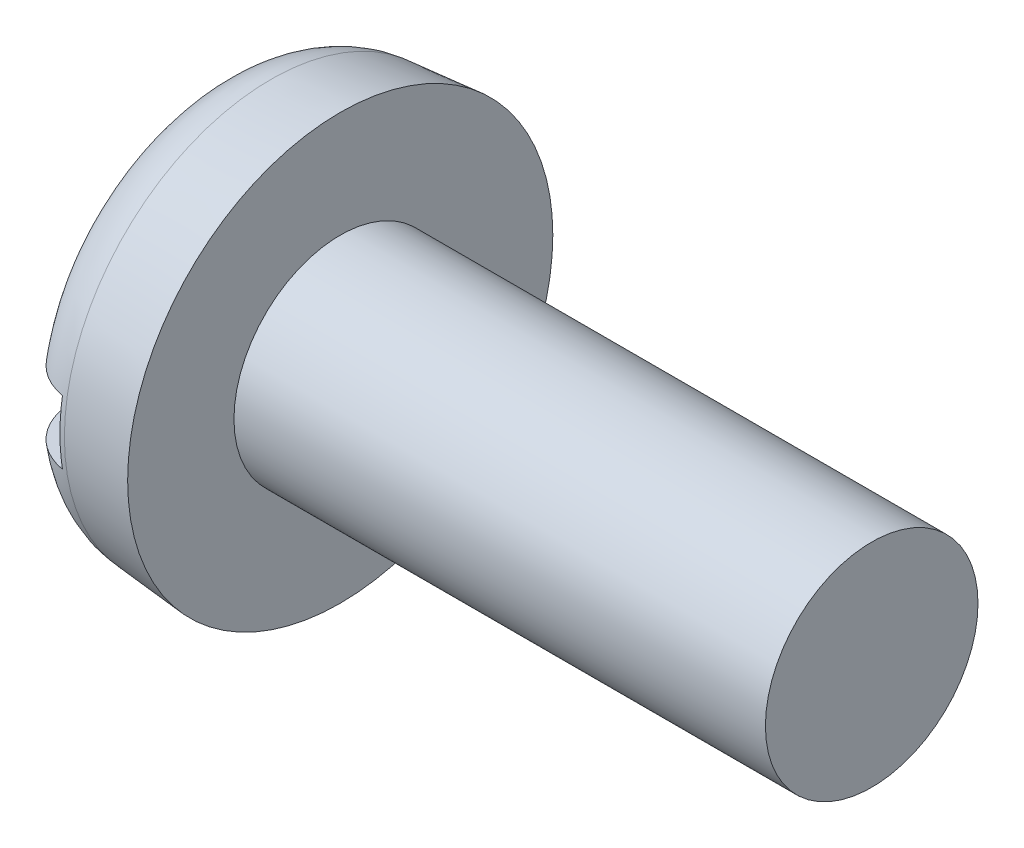
ISO-10303-21;
HEADER;
FILE_DESCRIPTION(('STEP AP214'),'2;1');
FILE_NAME('part.step','',(''),(''),'','','');
FILE_SCHEMA(('AUTOMOTIVE_DESIGN { 1 0 10303 214 1 1 1 1 }'));
ENDSEC;
DATA;
#1=APPLICATION_CONTEXT('core data for automotive mechanical design processes');
#2=APPLICATION_PROTOCOL_DEFINITION('international standard','automotive_design',2000,#1);
#3=PRODUCT_CONTEXT('',#1,'mechanical');
#4=PRODUCT('Part','Part','',(#3));
#5=PRODUCT_RELATED_PRODUCT_CATEGORY('part','',(#4));
#6=PRODUCT_DEFINITION_FORMATION('','',#4);
#7=PRODUCT_DEFINITION_CONTEXT('part definition',#1,'design');
#8=PRODUCT_DEFINITION('design','',#6,#7);
#9=PRODUCT_DEFINITION_SHAPE('','',#8);
#10=(LENGTH_UNIT() NAMED_UNIT(*) SI_UNIT(.MILLI.,.METRE.));
#11=(NAMED_UNIT(*) PLANE_ANGLE_UNIT() SI_UNIT($,.RADIAN.));
#12=(NAMED_UNIT(*) SI_UNIT($,.STERADIAN.) SOLID_ANGLE_UNIT());
#13=UNCERTAINTY_MEASURE_WITH_UNIT(LENGTH_MEASURE(1.E-05),#10,'distance_accuracy_value','');
#14=(GEOMETRIC_REPRESENTATION_CONTEXT(3) GLOBAL_UNCERTAINTY_ASSIGNED_CONTEXT((#13)) GLOBAL_UNIT_ASSIGNED_CONTEXT((#10,
#11,#12)) REPRESENTATION_CONTEXT('',''));
#15=CARTESIAN_POINT('',(0.,0.,0.));
#16=DIRECTION('',(0.,0.,1.));
#17=DIRECTION('',(1.,0.,0.));
#18=AXIS2_PLACEMENT_3D('',#15,#16,#17);
#19=CARTESIAN_POINT('',(0.,0.,0.));
#20=DIRECTION('',(-1.,0.,0.));
#21=DIRECTION('',(0.,0.,1.));
#22=AXIS2_PLACEMENT_3D('',#19,#20,#21);
#23=PLANE('',#22);
#24=DIRECTION('',(0.,0.,-1.));
#25=VECTOR('',#24,1.);
#26=CARTESIAN_POINT('',(0.,0.599999999999999,4.));
#27=LINE('',#26,#25);
#28=CARTESIAN_POINT('',(0.,0.599999999999999,2.62267277825956));
#29=VERTEX_POINT('',#28);
#30=CARTESIAN_POINT('',(0.,0.599999999999999,-2.62267277825956));
#31=VERTEX_POINT('',#30);
#32=EDGE_CURVE('E85',#29,#31,#27,.T.);
#33=ORIENTED_EDGE('',*,*,#32,.F.);
#34=CARTESIAN_POINT('',(0.,0.,0.));
#35=DIRECTION('',(-1.,0.,0.));
#36=DIRECTION('',(0.,0.,1.));
#37=AXIS2_PLACEMENT_3D('',#34,#35,#36);
#38=CIRCLE('',#37,2.69042979871687);
#39=EDGE_CURVE('E91',#29,#31,#38,.T.);
#40=ORIENTED_EDGE('',*,*,#39,.T.);
#41=EDGE_LOOP('',(#33,#40));
#42=FACE_BOUND('',#41,.T.);
#43=ADVANCED_FACE('F32',(#42),#23,.T.);
#44=CARTESIAN_POINT('',(-25.4,0.,0.));
#45=DIRECTION('',(-1.,0.,0.));
#46=DIRECTION('',(0.,0.,1.));
#47=AXIS2_PLACEMENT_3D('',#44,#45,#46);
#48=CYLINDRICAL_SURFACE('',#47,2.);
#49=CARTESIAN_POINT('',(12.4,0.,0.));
#50=DIRECTION('',(-1.,0.,0.));
#51=DIRECTION('',(0.,0.,1.));
#52=AXIS2_PLACEMENT_3D('',#49,#50,#51);
#53=CIRCLE('',#52,2.);
#54=CARTESIAN_POINT('',(12.4,0.,2.));
#55=VERTEX_POINT('',#54);
#56=EDGE_CURVE('E148',#55,#55,#53,.T.);
#57=ORIENTED_EDGE('',*,*,#56,.T.);
#58=EDGE_LOOP('',(#57));
#59=FACE_BOUND('',#58,.T.);
#60=CARTESIAN_POINT('',(2.4,0.,0.));
#61=DIRECTION('',(-1.,0.,0.));
#62=DIRECTION('',(0.,0.,1.));
#63=AXIS2_PLACEMENT_3D('',#60,#61,#62);
#64=CIRCLE('',#63,2.);
#65=CARTESIAN_POINT('',(2.4,0.,2.));
#66=VERTEX_POINT('',#65);
#67=EDGE_CURVE('E92',#66,#66,#64,.T.);
#68=ORIENTED_EDGE('',*,*,#67,.F.);
#69=EDGE_LOOP('',(#68));
#70=FACE_BOUND('',#69,.T.);
#71=ADVANCED_FACE('F137',(#59,#70),#48,.T.);
#72=CARTESIAN_POINT('',(2.4,2.,0.));
#73=DIRECTION('',(-1.,0.,0.));
#74=DIRECTION('',(0.,0.,1.));
#75=AXIS2_PLACEMENT_3D('',#72,#73,#74);
#76=PLANE('',#75);
#77=CARTESIAN_POINT('',(2.4,0.,0.));
#78=DIRECTION('',(-1.,0.,0.));
#79=DIRECTION('',(0.,0.,1.));
#80=AXIS2_PLACEMENT_3D('',#77,#78,#79);
#81=CIRCLE('',#80,4.);
#82=CARTESIAN_POINT('',(2.4,0.,4.));
#83=VERTEX_POINT('',#82);
#84=EDGE_CURVE('E97',#83,#83,#81,.T.);
#85=ORIENTED_EDGE('',*,*,#84,.F.);
#86=EDGE_LOOP('',(#85));
#87=FACE_BOUND('',#86,.T.);
#88=ORIENTED_EDGE('',*,*,#67,.T.);
#89=EDGE_LOOP('',(#88));
#90=FACE_BOUND('',#89,.T.);
#91=ADVANCED_FACE('F134',(#87,#90),#76,.F.);
#92=CARTESIAN_POINT('',(0.,0.,0.));
#93=DIRECTION('',(1.,0.,0.));
#94=DIRECTION('',(0.,0.,-1.));
#95=AXIS2_PLACEMENT_3D('',#92,#93,#94);
#96=CONICAL_SURFACE('',#95,3.79002720753778,0.0872664625997168);
#97=CARTESIAN_POINT('',(1.09541310870281,0.,0.));
#98=DIRECTION('',(-1.,0.,0.));
#99=DIRECTION('',(0.,0.,1.));
#100=AXIS2_PLACEMENT_3D('',#97,#98,#99);
#101=CIRCLE('',#100,3.88586343642697);
#102=CARTESIAN_POINT('',(1.09541310870281,0.,3.88586343642697));
#103=VERTEX_POINT('',#102);
#104=EDGE_CURVE('E95',#103,#103,#101,.F.);
#105=ORIENTED_EDGE('',*,*,#104,.T.);
#106=EDGE_LOOP('',(#105));
#107=FACE_BOUND('',#106,.T.);
#108=ORIENTED_EDGE('',*,*,#84,.T.);
#109=EDGE_LOOP('',(#108));
#110=FACE_BOUND('',#109,.T.);
#111=ADVANCED_FACE('F131',(#107,#110),#96,.T.);
#112=DIRECTION('',(0.,0.,1.));
#113=VECTOR('',#112,1.);
#114=CARTESIAN_POINT('',(0.,-0.599999999999999,-4.));
#115=LINE('',#114,#113);
#116=CARTESIAN_POINT('',(0.,-0.6,-2.62267277825956));
#117=VERTEX_POINT('',#116);
#118=CARTESIAN_POINT('',(0.,-0.6,2.62267277825956));
#119=VERTEX_POINT('',#118);
#120=EDGE_CURVE('E76',#117,#119,#115,.T.);
#121=ORIENTED_EDGE('',*,*,#120,.F.);
#122=EDGE_CURVE('E83',#117,#119,#38,.T.);
#123=ORIENTED_EDGE('',*,*,#122,.T.);
#124=EDGE_LOOP('',(#121,#123));
#125=FACE_BOUND('',#124,.T.);
#126=ADVANCED_FACE('F82',(#125),#23,.T.);
#127=CARTESIAN_POINT('',(12.4,2.,0.));
#128=DIRECTION('',(1.,0.,0.));
#129=DIRECTION('',(0.,0.,-1.));
#130=AXIS2_PLACEMENT_3D('',#127,#128,#129);
#131=PLANE('',#130);
#132=ORIENTED_EDGE('',*,*,#56,.F.);
#133=EDGE_LOOP('',(#132));
#134=FACE_BOUND('',#133,.T.);
#135=ADVANCED_FACE('F124',(#134),#131,.T.);
#136=CARTESIAN_POINT('',(1.2,0.,0.));
#137=DIRECTION('',(-1.,0.,0.));
#138=DIRECTION('',(0.,0.,1.));
#139=AXIS2_PLACEMENT_3D('',#136,#137,#138);
#140=TOROIDAL_SURFACE('',#139,2.69042979871687,1.2);
#141=CARTESIAN_POINT('',(0.3865043853169,0.599999999999999,-3.52185650961921));
#142=CARTESIAN_POINT('',(0.435468376809704,0.599999999999999,-3.56765543950952));
#143=CARTESIAN_POINT('',(0.48830443166393,0.599999999999999,-3.60938194550438));
#144=CARTESIAN_POINT('',(0.600265100914025,0.599999999999999,-3.68342203989747));
#145=CARTESIAN_POINT('',(0.659396459727369,0.599999999999999,-3.71572539150948));
#146=CARTESIAN_POINT('',(0.782252800606727,0.599999999999999,-3.76991557956983));
#147=CARTESIAN_POINT('',(0.845977179530534,0.599999999999999,-3.79180378084656));
#148=CARTESIAN_POINT('',(0.976191754222355,0.599999999999999,-3.82450279747539));
#149=CARTESIAN_POINT('',(1.04268130135997,0.599999999999999,-3.83531619558205));
#150=CARTESIAN_POINT('',(1.1761990045803,0.599999999999999,-3.84552483404158));
#151=CARTESIAN_POINT('',(1.2432228557012,0.599999999999999,-3.84497642083092));
#152=CARTESIAN_POINT('',(1.37622462279157,0.599999999999999,-3.83261582080468));
#153=CARTESIAN_POINT('',(1.44220252316781,0.599999999999999,-3.82080346622443));
#154=CARTESIAN_POINT('',(1.57113854491409,0.599999999999999,-3.7862937263228));
#155=CARTESIAN_POINT('',(1.63410108094123,0.599999999999999,-3.76361282457044));
#156=CARTESIAN_POINT('',(1.75534617576328,0.599999999999999,-3.70804459286004));
#157=CARTESIAN_POINT('',(1.81362870200937,0.599999999999999,-3.67515719192498));
#158=CARTESIAN_POINT('',(1.92413366286082,0.599999999999999,-3.5999836273889));
#159=CARTESIAN_POINT('',(1.97632984172852,0.599999999999999,-3.55765888229068));
#160=CARTESIAN_POINT('',(2.07296076151814,0.599999999999999,-3.46492588821896));
#161=CARTESIAN_POINT('',(2.11739523777237,0.599999999999999,-3.4145173637076));
#162=CARTESIAN_POINT('',(2.19773705811253,0.599999999999999,-3.30652404667824));
#163=CARTESIAN_POINT('',(2.2335546401034,0.599999999999999,-3.24887250133257));
#164=CARTESIAN_POINT('',(2.29517588977537,0.599999999999999,-3.12844912915973));
#165=CARTESIAN_POINT('',(2.32097889847265,0.599999999999999,-3.06567696571194));
#166=CARTESIAN_POINT('',(2.36230436492476,0.599999999999999,-2.93572304072211));
#167=CARTESIAN_POINT('',(2.37765465772828,0.599999999999999,-2.86848656449));
#168=CARTESIAN_POINT('',(2.39710654163142,0.599999999999999,-2.73240889874387));
#169=CARTESIAN_POINT('',(2.40120699584,0.599999999999999,-2.66356754775263));
#170=CARTESIAN_POINT('',(2.39814758674929,0.599999999999999,-2.52464946510971));
#171=CARTESIAN_POINT('',(2.39074269705667,0.599999999999999,-2.45457815120699));
#172=CARTESIAN_POINT('',(2.36454808289107,0.599999999999999,-2.31659764121423));
#173=CARTESIAN_POINT('',(2.34575688405122,0.599999999999999,-2.24868872632324));
#174=CARTESIAN_POINT('',(2.29682890298537,0.599999999999999,-2.11531585439699));
#175=CARTESIAN_POINT('',(2.26644200737333,0.599999999999999,-2.04994358052463));
#176=CARTESIAN_POINT('',(2.19524076438291,0.599999999999999,-1.92513363217192));
#177=CARTESIAN_POINT('',(2.15442449061928,0.599999999999999,-1.86569705688398));
#178=CARTESIAN_POINT('',(2.06294283615072,0.599999999999999,-1.75389115472998));
#179=CARTESIAN_POINT('',(2.01217853911869,0.599999999999999,-1.70160258750062));
#180=CARTESIAN_POINT('',(1.90235992553189,0.599999999999999,-1.60657192610496));
#181=CARTESIAN_POINT('',(1.84330597883632,0.599999999999999,-1.56382940624313));
#182=CARTESIAN_POINT('',(1.72028944869469,0.599999999999999,-1.49071034856236));
#183=CARTESIAN_POINT('',(1.65652070699639,0.599999999999999,-1.46000898173593));
#184=CARTESIAN_POINT('',(1.52445964441105,0.599999999999999,-1.41076217920832));
#185=CARTESIAN_POINT('',(1.45617085097405,0.599999999999999,-1.39220738465179));
#186=CARTESIAN_POINT('',(1.32258878880617,0.599999999999999,-1.3692588518075));
#187=CARTESIAN_POINT('',(1.25746124888691,0.599999999999999,-1.36389765676798));
#188=CARTESIAN_POINT('',(1.12729576266396,0.599999999999999,-1.36480396434978));
#189=CARTESIAN_POINT('',(1.06225779788543,0.599999999999999,-1.37106853009552));
#190=CARTESIAN_POINT('',(0.937361276352802,0.599999999999999,-1.39427975018108));
#191=CARTESIAN_POINT('',(0.877403715043033,0.599999999999999,-1.41070181584546));
#192=CARTESIAN_POINT('',(0.760914633899446,0.599999999999999,-1.45296891322572));
#193=CARTESIAN_POINT('',(0.704383858553245,0.599999999999999,-1.47881598407843));
#194=CARTESIAN_POINT('',(0.59370506692464,0.599999999999999,-1.54020998774752));
#195=CARTESIAN_POINT('',(0.539760317072122,0.599999999999999,-1.57612236406225));
#196=CARTESIAN_POINT('',(0.438104558678888,0.599999999999999,-1.65588570791735));
#197=CARTESIAN_POINT('',(0.390395455034547,0.599999999999999,-1.69973909160234));
#198=CARTESIAN_POINT('',(0.298820307456313,0.599999999999999,-1.79776253460882));
#199=CARTESIAN_POINT('',(0.255521278582641,0.599999999999999,-1.85246315819191));
#200=CARTESIAN_POINT('',(0.178283828688256,0.599999999999999,-1.96812037142371));
#201=CARTESIAN_POINT('',(0.144347592259656,0.599999999999999,-2.02907841655305));
#202=CARTESIAN_POINT('',(0.0855336536520217,0.599999999999999,-2.15824220692981));
#203=CARTESIAN_POINT('',(0.0610804571278224,0.599999999999999,-2.22664188136111));
#204=CARTESIAN_POINT('',(0.0240295264344845,0.599999999999999,-2.36658228123931));
#205=CARTESIAN_POINT('',(0.0114315794261263,0.599999999999999,-2.43812295027129));
#206=CARTESIAN_POINT('',(-0.00140349275074647,0.599999999999999,-2.58214276994531));
#207=CARTESIAN_POINT('',(-0.00166960935095198,0.599999999999999,-2.65461931871753));
#208=CARTESIAN_POINT('',(0.0102529782153528,0.599999999999999,-2.79856484207324));
#209=CARTESIAN_POINT('',(0.0224436067069672,0.599999999999999,-2.87003365925244));
#210=CARTESIAN_POINT('',(0.0586721532419449,0.599999999999999,-3.00828260141836));
#211=CARTESIAN_POINT('',(0.082454203778735,0.599999999999999,-3.07512990163236));
#212=CARTESIAN_POINT('',(0.141152556498101,0.599999999999999,-3.20367573836961));
#213=CARTESIAN_POINT('',(0.176053519221631,0.599999999999999,-3.26538122136565));
#214=CARTESIAN_POINT('',(0.240740330961717,0.599999999999999,-3.35956174501863));
#215=CARTESIAN_POINT('',(0.267410079737719,0.599999999999999,-3.39421743119418));
#216=CARTESIAN_POINT('',(0.324340073246241,0.599999999999999,-3.46044388227296));
#217=CARTESIAN_POINT('',(0.354600266126854,0.599999999999999,-3.49201469171488));
#218=CARTESIAN_POINT('',(0.3865043853169,0.599999999999999,-3.52185650961921));
#219=B_SPLINE_CURVE_WITH_KNOTS('',3,(#141,#142,#143,#144,#145,#146,#147,#148,#149,#150,#151,
#152,#153,#154,#155,#156,#157,#158,#159,#160,#161,#162,#163,#164,#165,#166,#167,#168,#169,#170,
#171,#172,#173,#174,#175,#176,#177,#178,#179,#180,#181,#182,#183,#184,#185,#186,#187,#188,#189,
#190,#191,#192,#193,#194,#195,#196,#197,#198,#199,#200,#201,#202,#203,#204,#205,#206,#207,#208,
#209,#210,#211,#212,#213,#214,#215,#216,#217,#218),.UNSPECIFIED.,.T.,.F.,(4,2,2,2,2,2,2,2,2,2,2,
2,2,2,2,2,2,2,2,2,2,2,2,2,2,2,2,2,2,2,2,2,2,2,2,2,2,2,4),(0.,0.200976827189781,
0.402171178117275,0.603339156747841,0.804460210309258,1.0045840875019,1.2047109453777,
1.40453524080546,1.60436092586269,1.80501901970634,2.00568395449112,2.2083565471812,
2.41104247397172,2.61699090874966,2.82296015558702,3.03337636492947,3.24381982603506,
3.45908552978543,3.67439102352243,3.8919572416663,4.10951375574479,4.32071351243114,
4.53175034894182,4.72677835820256,4.92175710659851,5.10742155193663,5.29312619036203,
5.48672044544048,5.68037370311709,5.88873369221815,6.09714225629056,6.31402614196828,
6.53090613382009,6.74727622721936,6.96367975064832,7.17550906691658,7.38704740347418,
7.51800243886491,7.64895558328008),.UNSPECIFIED.);
#220=CARTESIAN_POINT('',(1.,0.599999999999999,-3.8268957965744));
#221=VERTEX_POINT('',#220);
#222=EDGE_CURVE('E11',#31,#221,#219,.T.);
#223=ORIENTED_EDGE('',*,*,#222,.F.);
#224=ORIENTED_EDGE('',*,*,#39,.F.);
#225=CARTESIAN_POINT('',(0.568676477126929,0.599999999999999,1.55841219856782));
#226=CARTESIAN_POINT('',(0.622454061519845,0.599999999999999,1.52276443315215));
#227=CARTESIAN_POINT('',(0.679085716452424,0.599999999999999,1.49137245660808));
#228=CARTESIAN_POINT('',(0.796770781061295,0.599999999999999,1.43831139913973));
#229=CARTESIAN_POINT('',(0.857825465915767,0.599999999999999,1.41664513523963));
#230=CARTESIAN_POINT('',(0.982921778240514,0.599999999999999,1.38402811970607));
#231=CARTESIAN_POINT('',(1.04697051839889,0.599999999999999,1.37310440096336));
#232=CARTESIAN_POINT('',(1.17597937280705,0.599999999999999,1.36268675649643));
#233=CARTESIAN_POINT('',(1.24093916907112,0.599999999999999,1.36318893735937));
#234=CARTESIAN_POINT('',(1.36722529622797,0.599999999999999,1.37533615419168));
#235=CARTESIAN_POINT('',(1.42859438960398,0.599999999999999,1.38654477678901));
#236=CARTESIAN_POINT('',(1.54865022673253,0.599999999999999,1.41889802550638));
#237=CARTESIAN_POINT('',(1.60733638360584,0.599999999999999,1.44004481424829));
#238=CARTESIAN_POINT('',(1.72180457656256,0.599999999999999,1.49189888249434));
#239=CARTESIAN_POINT('',(1.77749881244469,0.599999999999999,1.52279911024804));
#240=CARTESIAN_POINT('',(1.88340638074354,0.599999999999999,1.59287167663913));
#241=CARTESIAN_POINT('',(1.93361816896039,0.599999999999999,1.63204633680305));
#242=CARTESIAN_POINT('',(2.03113053497861,0.599999999999999,1.7207614861352));
#243=CARTESIAN_POINT('',(2.07792119444347,0.599999999999999,1.77086293673741));
#244=CARTESIAN_POINT('',(2.16295007599264,0.599999999999999,1.87786529036718));
#245=CARTESIAN_POINT('',(2.20118595075152,0.599999999999999,1.93476805303438));
#246=CARTESIAN_POINT('',(2.26997158299282,0.599999999999999,2.05705672204257));
#247=CARTESIAN_POINT('',(2.30000838199075,0.599999999999999,2.12273201555222));
#248=CARTESIAN_POINT('',(2.34872218014288,0.599999999999999,2.25817360358701));
#249=CARTESIAN_POINT('',(2.36739836171025,0.599999999999999,2.32794019215335));
#250=CARTESIAN_POINT('',(2.39284815237816,0.599999999999999,2.47012141242115));
#251=CARTESIAN_POINT('',(2.3995382972578,0.599999999999999,2.54255105592489));
#252=CARTESIAN_POINT('',(2.40041533887494,0.599999999999999,2.68749005243388));
#253=CARTESIAN_POINT('',(2.39460324885111,0.599999999999999,2.75999939850365));
#254=CARTESIAN_POINT('',(2.37072428476735,0.599999999999999,2.90156578263792));
#255=CARTESIAN_POINT('',(2.35289092673648,0.599999999999999,2.97066215823505));
#256=CARTESIAN_POINT('',(2.3055955770595,0.599999999999999,3.10475609674243));
#257=CARTESIAN_POINT('',(2.2761350498973,0.599999999999999,3.16975417465279));
#258=CARTESIAN_POINT('',(2.20718370493829,0.599999999999999,3.29217559119934));
#259=CARTESIAN_POINT('',(2.16794580249016,0.599999999999999,3.34974141030858));
#260=CARTESIAN_POINT('',(2.08018656306587,0.599999999999999,3.45730019740039));
#261=CARTESIAN_POINT('',(2.03166624705526,0.599999999999999,3.50729399714103));
#262=CARTESIAN_POINT('',(1.92773605748678,0.599999999999999,3.59728886715384));
#263=CARTESIAN_POINT('',(1.87247613996759,0.599999999999999,3.63746317437641));
#264=CARTESIAN_POINT('',(1.75592540292466,0.599999999999999,3.70782235171269));
#265=CARTESIAN_POINT('',(1.69463504571076,0.599999999999999,3.73800798681217));
#266=CARTESIAN_POINT('',(1.5686108009079,0.599999999999999,3.78714975160721));
#267=CARTESIAN_POINT('',(1.50393088849995,0.599999999999999,3.80624437320328));
#268=CARTESIAN_POINT('',(1.37227430939355,0.599999999999999,3.83322369713973));
#269=CARTESIAN_POINT('',(1.30529774461387,0.599999999999999,3.84110889626411));
#270=CARTESIAN_POINT('',(1.17141837940069,0.599999999999999,3.845417811014));
#271=CARTESIAN_POINT('',(1.10451797377363,0.599999999999999,3.841916324645));
#272=CARTESIAN_POINT('',(0.972258074431341,0.599999999999999,3.82372114471701));
#273=CARTESIAN_POINT('',(0.906898557745326,0.599999999999999,3.80902761811221));
#274=CARTESIAN_POINT('',(0.779620440228249,0.599999999999999,3.76890152465441));
#275=CARTESIAN_POINT('',(0.717699255794829,0.599999999999999,3.74347714811327));
#276=CARTESIAN_POINT('',(0.598976238211882,0.599999999999999,3.68264222561395));
#277=CARTESIAN_POINT('',(0.542174462712433,0.599999999999999,3.64723156721798));
#278=CARTESIAN_POINT('',(0.434989019072863,0.599999999999999,3.56726339139053));
#279=CARTESIAN_POINT('',(0.384638229090172,0.599999999999999,3.5226618217776));
#280=CARTESIAN_POINT('',(0.292043532500023,0.599999999999999,3.42571932532332));
#281=CARTESIAN_POINT('',(0.249799950561467,0.599999999999999,3.37337808868051));
#282=CARTESIAN_POINT('',(0.174110902421625,0.599999999999999,3.26185326454057));
#283=CARTESIAN_POINT('',(0.140765250964864,0.599999999999999,3.20260196250881));
#284=CARTESIAN_POINT('',(0.0843091643064699,0.599999999999999,3.07941230405214));
#285=CARTESIAN_POINT('',(0.0611994814825061,0.599999999999999,3.01547360349034));
#286=CARTESIAN_POINT('',(0.0254327012378003,0.599999999999999,2.88357716459047));
#287=CARTESIAN_POINT('',(0.0129588753704508,0.599999999999999,2.81556976232472));
#288=CARTESIAN_POINT('',(-0.000658781010700943,0.599999999999999,2.67843562003149));
#289=CARTESIAN_POINT('',(-0.00180186106782006,0.599999999999999,2.60930880616698));
#290=CARTESIAN_POINT('',(0.00723867891158708,0.599999999999999,2.47027110364398));
#291=CARTESIAN_POINT('',(0.0176724417902891,0.599999999999999,2.40037650260934));
#292=CARTESIAN_POINT('',(0.0498636504049293,0.599999999999999,2.2632278015059));
#293=CARTESIAN_POINT('',(0.0716251168828932,0.599999999999999,2.19597464813441));
#294=CARTESIAN_POINT('',(0.126425020715145,0.599999999999999,2.06442921293427));
#295=CARTESIAN_POINT('',(0.159709015024554,0.599999999999999,2.00023925601918));
#296=CARTESIAN_POINT('',(0.236484744278742,0.599999999999999,1.87833288963111));
#297=CARTESIAN_POINT('',(0.279968016836232,0.599999999999999,1.82061117178714));
#298=CARTESIAN_POINT('',(0.363480541370638,0.599999999999999,1.7273106274393));
#299=CARTESIAN_POINT('',(0.401461969531133,0.599999999999999,1.68987927171622));
#300=CARTESIAN_POINT('',(0.481873574560197,0.599999999999999,1.62013708106612));
#301=CARTESIAN_POINT('',(0.524303465131614,0.599999999999999,1.58782591694606));
#302=CARTESIAN_POINT('',(0.568676477126929,0.599999999999999,1.55841219856782));
#303=B_SPLINE_CURVE_WITH_KNOTS('',3,(#225,#226,#227,#228,#229,#230,#231,#232,#233,#234,#235,
#236,#237,#238,#239,#240,#241,#242,#243,#244,#245,#246,#247,#248,#249,#250,#251,#252,#253,#254,
#255,#256,#257,#258,#259,#260,#261,#262,#263,#264,#265,#266,#267,#268,#269,#270,#271,#272,#273,
#274,#275,#276,#277,#278,#279,#280,#281,#282,#283,#284,#285,#286,#287,#288,#289,#290,#291,#292,
#293,#294,#295,#296,#297,#298,#299,#300,#301,#302),.UNSPECIFIED.,.T.,.F.,(4,2,2,2,2,2,2,2,2,2,2,
2,2,2,2,2,2,2,2,2,2,2,2,2,2,2,2,2,2,2,2,2,2,2,2,2,2,2,4),(0.,0.193385513919528,
0.386827005300377,0.580754042961623,0.774615000337378,0.960896687777685,1.14721893033819,
1.33748625970806,1.52780704274837,1.73256769583997,1.93738446396625,2.15302491989022,
2.3686808929236,2.58583282429252,2.80296715733262,3.01600070675181,3.22900743238556,
3.43699107594611,3.64495185668385,3.84892478048635,4.05288207933736,4.25423457873796,
4.45557815423367,4.65560180218055,4.85562246638807,5.05549074028575,5.25536126463506,
5.45621303485321,5.6570728468932,5.86009921029704,6.06314049433699,6.26961358281206,
6.47610034629815,6.68713711809029,6.89824884802286,7.11416888630089,7.3299104045327,
7.4894871090411,7.64905354970112),.UNSPECIFIED.);
#304=CARTESIAN_POINT('',(1.,0.599999999999999,3.8268957965744));
#305=VERTEX_POINT('',#304);
#306=EDGE_CURVE('E109',#305,#29,#303,.T.);
#307=ORIENTED_EDGE('',*,*,#306,.F.);
#308=CARTESIAN_POINT('',(1.,0.,0.));
#309=DIRECTION('',(-1.,0.,0.));
#310=DIRECTION('',(0.,0.,1.));
#311=AXIS2_PLACEMENT_3D('',#308,#309,#310);
#312=CIRCLE('',#311,3.8736457553368);
#313=CARTESIAN_POINT('',(1.,-0.600000000000001,3.8268957965744));
#314=VERTEX_POINT('',#313);
#315=EDGE_CURVE('E103',#305,#314,#312,.F.);
#316=ORIENTED_EDGE('',*,*,#315,.T.);
#317=CARTESIAN_POINT('',(0.568676477126929,-0.6,1.55841219856782));
#318=CARTESIAN_POINT('',(0.509332480081696,-0.6,1.59775463005653));
#319=CARTESIAN_POINT('',(0.453379737593402,-0.6,1.64234041456525));
#320=CARTESIAN_POINT('',(0.349719384744575,-0.6,1.74035526225764));
#321=CARTESIAN_POINT('',(0.302029039720169,-0.6,1.79380239724287));
#322=CARTESIAN_POINT('',(0.216237861171418,-0.6,1.90774469331987));
#323=CARTESIAN_POINT('',(0.178118215551581,-0.6,1.96822568065149));
#324=CARTESIAN_POINT('',(0.112363022359559,-0.6,2.0946004660025));
#325=CARTESIAN_POINT('',(0.0847225516651626,-0.6,2.16049170453784));
#326=CARTESIAN_POINT('',(0.0402688820654373,-0.6,2.29725613862916));
#327=CARTESIAN_POINT('',(0.0236758951143888,-0.6,2.36820113640267));
#328=CARTESIAN_POINT('',(0.00278349529055847,-0.6,2.51189141902525));
#329=CARTESIAN_POINT('',(-0.00151505382145721,-0.6,2.58463683000243));
#330=CARTESIAN_POINT('',(0.00243750090673764,-0.6,2.72894600466354));
#331=CARTESIAN_POINT('',(0.010543481691402,-0.6,2.80051368172528));
#332=CARTESIAN_POINT('',(0.0389520122111734,-0.6,2.94118836519469));
#333=CARTESIAN_POINT('',(0.0592529795943586,-0.6,3.01029568961161));
#334=CARTESIAN_POINT('',(0.110960599492527,-0.6,3.1423581794812));
#335=CARTESIAN_POINT('',(0.142096162922045,-0.6,3.20541948925911));
#336=CARTESIAN_POINT('',(0.214736034083397,-0.6,3.32525905847824));
#337=CARTESIAN_POINT('',(0.256239076662044,-0.6,3.38203808333359));
#338=CARTESIAN_POINT('',(0.347460043456084,-0.6,3.48641848567097));
#339=CARTESIAN_POINT('',(0.396982663622688,-0.6,3.53419059896752));
#340=CARTESIAN_POINT('',(0.503454251965738,-0.6,3.62058393955822));
#341=CARTESIAN_POINT('',(0.560402559792268,-0.600000000000001,3.6592059796888));
#342=CARTESIAN_POINT('',(0.67915616669242,-0.600000000000001,3.72559524176085));
#343=CARTESIAN_POINT('',(0.740873206774596,-0.600000000000001,3.75352040318466));
#344=CARTESIAN_POINT('',(0.868147447178384,-0.600000000000001,3.79850563248861));
#345=CARTESIAN_POINT('',(0.933704426101418,-0.600000000000001,3.81556632610715));
#346=CARTESIAN_POINT('',(1.06616217213646,-0.600000000000001,3.83820251592193));
#347=CARTESIAN_POINT('',(1.13304550883012,-0.600000000000001,3.84388011302821));
#348=CARTESIAN_POINT('',(1.26681198896937,-0.600000000000001,3.84388783413177));
#349=CARTESIAN_POINT('',(1.33369513237364,-0.600000000000001,3.83821825701912));
#350=CARTESIAN_POINT('',(1.46534857157599,-0.600000000000001,3.81573676186709));
#351=CARTESIAN_POINT('',(1.5301247220422,-0.600000000000001,3.79895909501043));
#352=CARTESIAN_POINT('',(1.65595122595357,-0.600000000000001,3.75479405535968));
#353=CARTESIAN_POINT('',(1.7170015759375,-0.600000000000001,3.72740667270942));
#354=CARTESIAN_POINT('',(1.83382644440954,-0.600000000000001,3.66274505096101));
#355=CARTESIAN_POINT('',(1.88958679570528,-0.6,3.62544522614553));
#356=CARTESIAN_POINT('',(1.99411858567963,-0.6,3.54208564924007));
#357=CARTESIAN_POINT('',(2.04288982717609,-0.6,3.49602565008659));
#358=CARTESIAN_POINT('',(2.1325144588672,-0.6,3.39605796805197));
#359=CARTESIAN_POINT('',(2.17329813230417,-0.6,3.34208780453369));
#360=CARTESIAN_POINT('',(2.245373715947,-0.6,3.22814724666567));
#361=CARTESIAN_POINT('',(2.27666509110745,-0.6,3.16817651433955));
#362=CARTESIAN_POINT('',(2.32937247927728,-0.6,3.04302336767031));
#363=CARTESIAN_POINT('',(2.35063955580864,-0.6,2.97777826220268));
#364=CARTESIAN_POINT('',(2.3821555435993,-0.6,2.84468257569051));
#365=CARTESIAN_POINT('',(2.39240345126148,-0.6,2.77683175790728));
#366=CARTESIAN_POINT('',(2.40182781167143,-0.6,2.6389851221972));
#367=CARTESIAN_POINT('',(2.40077563946762,-0.6,2.56897370296739));
#368=CARTESIAN_POINT('',(2.38721389375726,-0.6,2.43007140454125));
#369=CARTESIAN_POINT('',(2.37470291541564,-0.6,2.36118066379268));
#370=CARTESIAN_POINT('',(2.33824897531091,-0.6,2.22476443245793));
#371=CARTESIAN_POINT('',(2.31404566003784,-0.6,2.15730848180475));
#372=CARTESIAN_POINT('',(2.25484108748274,-0.6,2.02730649407732));
#373=CARTESIAN_POINT('',(2.21983804177323,-0.6,1.96476127236982));
#374=CARTESIAN_POINT('',(2.13932874736706,-0.6,1.8453529307582));
#375=CARTESIAN_POINT('',(2.09366234590785,-0.6,1.78859760711137));
#376=CARTESIAN_POINT('',(1.99331431191753,-0.6,1.68367587763201));
#377=CARTESIAN_POINT('',(1.93863170276046,-0.6,1.63551040342055));
#378=CARTESIAN_POINT('',(1.82254625777846,-0.6,1.55016942745779));
#379=CARTESIAN_POINT('',(1.7612597676297,-0.6,1.51283623240993));
#380=CARTESIAN_POINT('',(1.6329601699431,-0.6,1.44984263928338));
#381=CARTESIAN_POINT('',(1.56595104557599,-0.6,1.42417419949718));
#382=CARTESIAN_POINT('',(1.43290073806671,-0.6,1.38720166109767));
#383=CARTESIAN_POINT('',(1.36709528777327,-0.6,1.37505067605006));
#384=CARTESIAN_POINT('',(1.23436273799877,-0.6,1.3628486637136));
#385=CARTESIAN_POINT('',(1.16743586710567,-0.6,1.36279519978994));
#386=CARTESIAN_POINT('',(1.03904581845807,-0.6,1.37438428526506));
#387=CARTESIAN_POINT('',(0.97751125617985,-0.6,1.38526326860791));
#388=CARTESIAN_POINT('',(0.857136970802306,-0.6,1.41700902468275));
#389=CARTESIAN_POINT('',(0.79829431821811,-0.6,1.43786464264846));
#390=CARTESIAN_POINT('',(0.711456111583953,-0.6,1.47666141247908));
#391=CARTESIAN_POINT('',(0.681965827352731,-0.6,1.49136190349118));
#392=CARTESIAN_POINT('',(0.624300776091964,-0.6,1.52313858618549));
#393=CARTESIAN_POINT('',(0.596125848061598,-0.6,1.54021448609182));
#394=CARTESIAN_POINT('',(0.568676477126929,-0.6,1.55841219856782));
#395=B_SPLINE_CURVE_WITH_KNOTS('',3,(#317,#318,#319,#320,#321,#322,#323,#324,#325,#326,#327,
#328,#329,#330,#331,#332,#333,#334,#335,#336,#337,#338,#339,#340,#341,#342,#343,#344,#345,#346,
#347,#348,#349,#350,#351,#352,#353,#354,#355,#356,#357,#358,#359,#360,#361,#362,#363,#364,#365,
#366,#367,#368,#369,#370,#371,#372,#373,#374,#375,#376,#377,#378,#379,#380,#381,#382,#383,#384,
#385,#386,#387,#388,#389,#390,#391,#392,#393,#394),.UNSPECIFIED.,.T.,.F.,(4,2,2,2,2,2,2,2,2,2,2,
2,2,2,2,2,2,2,2,2,2,2,2,2,2,2,2,2,2,2,2,2,2,2,2,2,2,2,4),(0.,0.2134759624335,0.427392766410055,
0.640885745961928,0.854278301737505,1.07180637112245,1.28934972283257,1.50436737883906,
1.71935714140511,1.92931435926565,2.13924596835597,2.34467456156898,2.55008489891637,
2.75233330087855,2.95457005330195,3.15498457532821,3.355393818408,3.55518797077139,
3.75498230873912,3.95529744533289,4.15561823225944,4.35761633671561,4.55962582493594,
4.76454879865852,4.96949043464972,5.17858616575401,5.38770753516105,5.60171647610742,
5.815760875817,6.03325422888593,6.25077115609705,6.46494128219721,6.67896353412185,
6.87865214841024,7.07830054217249,7.26491113813759,7.4513135727773,7.55006829763245,
7.64881090295453),.UNSPECIFIED.);
#396=EDGE_CURVE('E90',#119,#314,#395,.T.);
#397=ORIENTED_EDGE('',*,*,#396,.F.);
#398=ORIENTED_EDGE('',*,*,#122,.F.);
#399=CARTESIAN_POINT('',(0.3865043853169,-0.6,-3.52185650961921));
#400=CARTESIAN_POINT('',(0.336558722817936,-0.6,-3.47513075128459));
#401=CARTESIAN_POINT('',(0.290567626669498,-0.6,-3.42409544249481));
#402=CARTESIAN_POINT('',(0.207816965280216,-0.6,-3.31495007041418));
#403=CARTESIAN_POINT('',(0.171070439103284,-0.6,-3.2568301841472));
#404=CARTESIAN_POINT('',(0.107859338601831,-0.6,-3.13533662847078));
#405=CARTESIAN_POINT('',(0.081381881164931,-0.6,-3.07196966378119));
#406=CARTESIAN_POINT('',(0.0392838045239969,-0.6,-2.94175448090331));
#407=CARTESIAN_POINT('',(0.0236604233379696,-0.6,-2.87490715300298));
#408=CARTESIAN_POINT('',(0.00341113760486152,-0.6,-2.73858284299162));
#409=CARTESIAN_POINT('',(-0.00105268697832654,-0.6,-2.66908182610821));
#410=CARTESIAN_POINT('',(0.00147102096325173,-0.6,-2.53028718374577));
#411=CARTESIAN_POINT('',(0.00846038782832012,-0.6,-2.46099359326887));
#412=CARTESIAN_POINT('',(0.0338721864648684,-0.6,-2.3228723752129));
#413=CARTESIAN_POINT('',(0.052556068631298,-0.6,-2.25409284303921));
#414=CARTESIAN_POINT('',(0.100979067357801,-0.6,-2.12053875671022));
#415=CARTESIAN_POINT('',(0.13071979970305,-0.6,-2.05576478951978));
#416=CARTESIAN_POINT('',(0.201105195458411,-0.6,-1.93075930525525));
#417=CARTESIAN_POINT('',(0.241951125893862,-0.6,-1.87064095947011));
#418=CARTESIAN_POINT('',(0.333200685376831,-0.6,-1.75812796287682));
#419=CARTESIAN_POINT('',(0.383605930277355,-0.6,-1.70573462052519));
#420=CARTESIAN_POINT('',(0.49243046214007,-0.6,-1.61063718358382));
#421=CARTESIAN_POINT('',(0.550808610996931,-0.6,-1.5678861594857));
#422=CARTESIAN_POINT('',(0.674249770660478,-0.6,-1.49345451157567));
#423=CARTESIAN_POINT('',(0.739309779543376,-0.6,-1.46176894435546));
#424=CARTESIAN_POINT('',(0.870462326091403,-0.6,-1.41247032078437));
#425=CARTESIAN_POINT('',(0.936297020329797,-0.6,-1.39417366440214));
#426=CARTESIAN_POINT('',(1.0701878817137,-0.6,-1.36992148518535));
#427=CARTESIAN_POINT('',(1.13824253020567,-0.6,-1.36395769819996));
#428=CARTESIAN_POINT('',(1.26912997895027,-0.6,-1.36469761541335));
#429=CARTESIAN_POINT('',(1.33196990988984,-0.6,-1.37048080826728));
#430=CARTESIAN_POINT('',(1.45576558833098,-0.6,-1.39257493590547));
#431=CARTESIAN_POINT('',(1.51672119125384,-0.6,-1.40888667642232));
#432=CARTESIAN_POINT('',(1.63489640297552,-0.6,-1.45115860213934));
#433=CARTESIAN_POINT('',(1.6921296079285,-0.6,-1.47708105144091));
#434=CARTESIAN_POINT('',(1.80183592700507,-0.6,-1.53754737472573));
#435=CARTESIAN_POINT('',(1.85430778082638,-0.6,-1.57209352232834));
#436=CARTESIAN_POINT('',(1.95690912307554,-0.6,-1.65139148227918));
#437=CARTESIAN_POINT('',(2.00661704093944,-0.6,-1.69668868803225));
#438=CARTESIAN_POINT('',(2.09829662711252,-0.6,-1.79453297422897));
#439=CARTESIAN_POINT('',(2.14026595598176,-0.6,-1.84708223866338));
#440=CARTESIAN_POINT('',(2.21793843806371,-0.6,-1.96160125448483));
#441=CARTESIAN_POINT('',(2.25307298841164,-0.6,-2.02395766218002));
#442=CARTESIAN_POINT('',(2.31259182505717,-0.6,-2.15361082605355));
#443=CARTESIAN_POINT('',(2.33697474860025,-0.6,-2.22090820723349));
#444=CARTESIAN_POINT('',(2.37457912576359,-0.6,-2.35984116372174));
#445=CARTESIAN_POINT('',(2.38759592572278,-0.6,-2.43153235295636));
#446=CARTESIAN_POINT('',(2.40121636652828,-0.6,-2.57608878641343));
#447=CARTESIAN_POINT('',(2.40182066121007,-0.6,-2.64895396859281));
#448=CARTESIAN_POINT('',(2.39052951432965,-0.6,-2.79263451592545));
#449=CARTESIAN_POINT('',(2.37881794070475,-0.6,-2.86346426605319));
#450=CARTESIAN_POINT('',(2.34337531701499,-0.6,-3.00205279186086));
#451=CARTESIAN_POINT('',(2.31964575206653,-0.6,-3.06981194586106));
#452=CARTESIAN_POINT('',(2.26145401587131,-0.6,-3.19862221749633));
#453=CARTESIAN_POINT('',(2.22725936765797,-0.6,-3.25979420628619));
#454=CARTESIAN_POINT('',(2.14887906874352,-0.6,-3.375364282916));
#455=CARTESIAN_POINT('',(2.10469456751171,-0.6,-3.42976314898057));
#456=CARTESIAN_POINT('',(2.00858874706972,-0.6,-3.52906182492364));
#457=CARTESIAN_POINT('',(1.95684621484288,-0.599999999999999,-3.57413473023197));
#458=CARTESIAN_POINT('',(1.84643427366472,-0.599999999999999,-3.65480066684373));
#459=CARTESIAN_POINT('',(1.78776544197083,-0.599999999999999,-3.6903944873571));
#460=CARTESIAN_POINT('',(1.66608419981984,-0.599999999999999,-3.75057174665135));
#461=CARTESIAN_POINT('',(1.60314657577032,-0.599999999999999,-3.77530647549706));
#462=CARTESIAN_POINT('',(1.47399447593328,-0.599999999999999,-3.81375981067266));
#463=CARTESIAN_POINT('',(1.40778030936549,-0.599999999999999,-3.82747945444091));
#464=CARTESIAN_POINT('',(1.27453622351246,-0.599999999999999,-3.84342379547403));
#465=CARTESIAN_POINT('',(1.20751747200586,-0.599999999999999,-3.8457419849666));
#466=CARTESIAN_POINT('',(1.07402733515046,-0.599999999999999,-3.83906549408965));
#467=CARTESIAN_POINT('',(1.00755608621229,-0.599999999999999,-3.83006807541837));
#468=CARTESIAN_POINT('',(0.877192041451646,-0.599999999999999,-3.80105552457798));
#469=CARTESIAN_POINT('',(0.813295013496225,-0.599999999999999,-3.78105934054213));
#470=CARTESIAN_POINT('',(0.68980965000885,-0.599999999999999,-3.73066689432686));
#471=CARTESIAN_POINT('',(0.630215948035525,-0.599999999999999,-3.7002838661004));
#472=CARTESIAN_POINT('',(0.540159992708922,-0.599999999999999,-3.64444320427522));
#473=CARTESIAN_POINT('',(0.507753552373781,-0.6,-3.62205529556096));
#474=CARTESIAN_POINT('',(0.445296371445687,-0.6,-3.57420610647407));
#475=CARTESIAN_POINT('',(0.415245615544329,-0.6,-3.54874484607634));
#476=CARTESIAN_POINT('',(0.3865043853169,-0.6,-3.52185650961921));
#477=B_SPLINE_CURVE_WITH_KNOTS('',3,(#399,#400,#401,#402,#403,#404,#405,#406,#407,#408,#409,
#410,#411,#412,#413,#414,#415,#416,#417,#418,#419,#420,#421,#422,#423,#424,#425,#426,#427,#428,
#429,#430,#431,#432,#433,#434,#435,#436,#437,#438,#439,#440,#441,#442,#443,#444,#445,#446,#447,
#448,#449,#450,#451,#452,#453,#454,#455,#456,#457,#458,#459,#460,#461,#462,#463,#464,#465,#466,
#467,#468,#469,#470,#471,#472,#473,#474,#475,#476),.UNSPECIFIED.,.T.,.F.,(4,2,2,2,2,2,2,2,2,2,2,
2,2,2,2,2,2,2,2,2,2,2,2,2,2,2,2,2,2,2,2,2,2,2,2,2,2,2,4),(0.,0.205037969202752,
0.410363534320727,0.615430667473672,0.82044559909627,1.02842128144384,1.23643027638083,
1.44926442923975,1.66212969670413,1.87914472895521,2.09619647696099,2.31216786529846,
2.52804264627132,2.73193279469976,2.93568627374503,3.12408907469174,3.31250629550759,
3.50019140951881,3.68792605866216,3.88881168169423,4.08975793491081,4.3034897344354,
4.51724861640217,4.73478137188874,4.95230266868953,5.16662200394876,5.38091486127847,
5.59013202130102,5.79932512026633,6.00419443464087,6.20904668666307,6.41094657757592,
6.61282745063575,6.81305010288988,7.01332121701587,7.2132483896169,7.41292177710625,
7.53091163814142,7.64890073235642),.UNSPECIFIED.);
#478=CARTESIAN_POINT('',(1.,-0.599999999999999,-3.8268957965744));
#479=VERTEX_POINT('',#478);
#480=EDGE_CURVE('E44',#479,#117,#477,.T.);
#481=ORIENTED_EDGE('',*,*,#480,.F.);
#482=EDGE_CURVE('E56',#479,#221,#312,.F.);
#483=ORIENTED_EDGE('',*,*,#482,.T.);
#484=EDGE_LOOP('',(#223,#224,#307,#316,#397,#398,#481,#483));
#485=FACE_BOUND('',#484,.T.);
#486=ORIENTED_EDGE('',*,*,#104,.F.);
#487=EDGE_LOOP('',(#486));
#488=FACE_BOUND('',#487,.T.);
#489=ADVANCED_FACE('F34',(#485,#488),#140,.T.);
#490=CARTESIAN_POINT('',(1.,0.599999999999999,4.));
#491=DIRECTION('',(0.,1.,0.));
#492=DIRECTION('',(0.,0.,1.));
#493=AXIS2_PLACEMENT_3D('',#490,#491,#492);
#494=PLANE('',#493);
#495=ORIENTED_EDGE('',*,*,#222,.T.);
#496=DIRECTION('',(0.,0.,-1.));
#497=VECTOR('',#496,1.);
#498=CARTESIAN_POINT('',(1.,0.599999999999999,4.));
#499=LINE('',#498,#497);
#500=EDGE_CURVE('E84',#305,#221,#499,.T.);
#501=ORIENTED_EDGE('',*,*,#500,.F.);
#502=ORIENTED_EDGE('',*,*,#306,.T.);
#503=ORIENTED_EDGE('',*,*,#32,.T.);
#504=EDGE_LOOP('',(#495,#501,#502,#503));
#505=FACE_BOUND('',#504,.T.);
#506=ADVANCED_FACE('F116',(#505),#494,.F.);
#507=CARTESIAN_POINT('',(1.,-0.599999999999999,-4.));
#508=DIRECTION('',(0.,-1.,0.));
#509=DIRECTION('',(0.,0.,-1.));
#510=AXIS2_PLACEMENT_3D('',#507,#508,#509);
#511=PLANE('',#510);
#512=ORIENTED_EDGE('',*,*,#480,.T.);
#513=ORIENTED_EDGE('',*,*,#120,.T.);
#514=ORIENTED_EDGE('',*,*,#396,.T.);
#515=DIRECTION('',(0.,0.,1.));
#516=VECTOR('',#515,1.);
#517=CARTESIAN_POINT('',(1.,-0.599999999999999,-4.));
#518=LINE('',#517,#516);
#519=EDGE_CURVE('E51',#479,#314,#518,.T.);
#520=ORIENTED_EDGE('',*,*,#519,.F.);
#521=EDGE_LOOP('',(#512,#513,#514,#520));
#522=FACE_BOUND('',#521,.T.);
#523=ADVANCED_FACE('F75',(#522),#511,.F.);
#524=CARTESIAN_POINT('',(1.,0.599999999999999,-4.));
#525=DIRECTION('',(-1.,0.,0.));
#526=DIRECTION('',(0.,0.,1.));
#527=AXIS2_PLACEMENT_3D('',#524,#525,#526);
#528=PLANE('',#527);
#529=ORIENTED_EDGE('',*,*,#519,.T.);
#530=ORIENTED_EDGE('',*,*,#315,.F.);
#531=ORIENTED_EDGE('',*,*,#500,.T.);
#532=ORIENTED_EDGE('',*,*,#482,.F.);
#533=EDGE_LOOP('',(#529,#530,#531,#532));
#534=FACE_BOUND('',#533,.T.);
#535=ADVANCED_FACE('F115',(#534),#528,.T.);
#536=CLOSED_SHELL('',(#43,#71,#91,#111,#126,#135,#489,#506,#523,#535));
#537=MANIFOLD_SOLID_BREP('B2',#536);
#538=ADVANCED_BREP_SHAPE_REPRESENTATION('',(#18,#537),#14);
#539=SHAPE_DEFINITION_REPRESENTATION(#9,#538);
ENDSEC;
END-ISO-10303-21;
